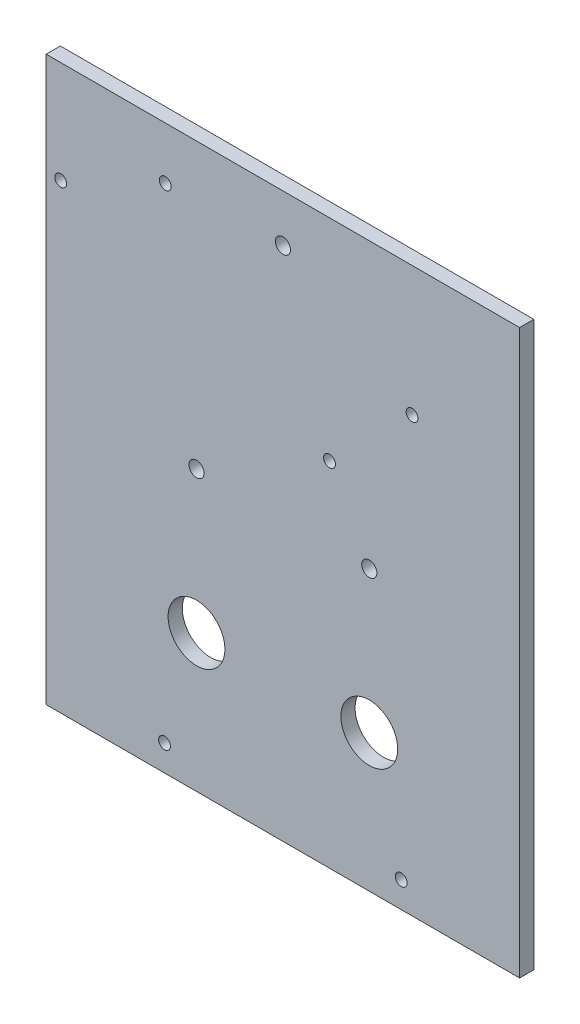
ISO-10303-21;
HEADER;
FILE_DESCRIPTION(('STEP AP214'),'2;1');
FILE_NAME('part.step','',(''),(''),'','','');
FILE_SCHEMA(('AUTOMOTIVE_DESIGN { 1 0 10303 214 1 1 1 1 }'));
ENDSEC;
DATA;
#1=APPLICATION_CONTEXT('core data for automotive mechanical design processes');
#2=APPLICATION_PROTOCOL_DEFINITION('international standard','automotive_design',2000,#1);
#3=PRODUCT_CONTEXT('',#1,'mechanical');
#4=PRODUCT('Part','Part','',(#3));
#5=PRODUCT_RELATED_PRODUCT_CATEGORY('part','',(#4));
#6=PRODUCT_DEFINITION_FORMATION('','',#4);
#7=PRODUCT_DEFINITION_CONTEXT('part definition',#1,'design');
#8=PRODUCT_DEFINITION('design','',#6,#7);
#9=PRODUCT_DEFINITION_SHAPE('','',#8);
#10=(LENGTH_UNIT() NAMED_UNIT(*) SI_UNIT(.MILLI.,.METRE.));
#11=(NAMED_UNIT(*) PLANE_ANGLE_UNIT() SI_UNIT($,.RADIAN.));
#12=(NAMED_UNIT(*) SI_UNIT($,.STERADIAN.) SOLID_ANGLE_UNIT());
#13=UNCERTAINTY_MEASURE_WITH_UNIT(LENGTH_MEASURE(1.E-05),#10,'distance_accuracy_value','');
#14=(GEOMETRIC_REPRESENTATION_CONTEXT(3) GLOBAL_UNCERTAINTY_ASSIGNED_CONTEXT((#13)) GLOBAL_UNIT_ASSIGNED_CONTEXT((#10,
#11,#12)) REPRESENTATION_CONTEXT('',''));
#15=CARTESIAN_POINT('',(0.,0.,0.));
#16=DIRECTION('',(0.,0.,1.));
#17=DIRECTION('',(1.,0.,0.));
#18=AXIS2_PLACEMENT_3D('',#15,#16,#17);
#19=CARTESIAN_POINT('',(50.,0.,3.));
#20=DIRECTION('',(1.,0.,0.));
#21=DIRECTION('',(0.,1.,0.));
#22=AXIS2_PLACEMENT_3D('',#19,#20,#21);
#23=PLANE('',#22);
#24=DIRECTION('',(0.,0.,1.));
#25=VECTOR('',#24,1.);
#26=CARTESIAN_POINT('',(50.,-59.,3.));
#27=LINE('',#26,#25);
#28=CARTESIAN_POINT('',(50.,-59.,0.));
#29=VERTEX_POINT('',#28);
#30=CARTESIAN_POINT('',(50.,-59.,3.));
#31=VERTEX_POINT('',#30);
#32=EDGE_CURVE('E141',#29,#31,#27,.T.);
#33=ORIENTED_EDGE('',*,*,#32,.F.);
#34=DIRECTION('',(0.,-1.,0.));
#35=VECTOR('',#34,1.);
#36=CARTESIAN_POINT('',(50.,0.,0.));
#37=LINE('',#36,#35);
#38=CARTESIAN_POINT('',(50.,60.,0.));
#39=VERTEX_POINT('',#38);
#40=EDGE_CURVE('E86',#39,#29,#37,.T.);
#41=ORIENTED_EDGE('',*,*,#40,.F.);
#42=DIRECTION('',(0.,0.,-1.));
#43=VECTOR('',#42,1.);
#44=CARTESIAN_POINT('',(50.,60.,3.));
#45=LINE('',#44,#43);
#46=CARTESIAN_POINT('',(50.,60.,3.));
#47=VERTEX_POINT('',#46);
#48=EDGE_CURVE('E11',#47,#39,#45,.T.);
#49=ORIENTED_EDGE('',*,*,#48,.F.);
#50=DIRECTION('',(0.,-1.,0.));
#51=VECTOR('',#50,1.);
#52=CARTESIAN_POINT('',(50.,0.,3.));
#53=LINE('',#52,#51);
#54=EDGE_CURVE('E82',#47,#31,#53,.T.);
#55=ORIENTED_EDGE('',*,*,#54,.T.);
#56=EDGE_LOOP('',(#33,#41,#49,#55));
#57=FACE_BOUND('',#56,.T.);
#58=ADVANCED_FACE('F34',(#57),#23,.T.);
#59=CARTESIAN_POINT('',(0.,60.,3.));
#60=DIRECTION('',(0.,1.,0.));
#61=DIRECTION('',(0.,0.,1.));
#62=AXIS2_PLACEMENT_3D('',#59,#60,#61);
#63=PLANE('',#62);
#64=DIRECTION('',(1.,0.,0.));
#65=VECTOR('',#64,1.);
#66=CARTESIAN_POINT('',(0.,60.,0.));
#67=LINE('',#66,#65);
#68=CARTESIAN_POINT('',(-50.,60.,0.));
#69=VERTEX_POINT('',#68);
#70=EDGE_CURVE('E80',#69,#39,#67,.T.);
#71=ORIENTED_EDGE('',*,*,#70,.F.);
#72=DIRECTION('',(0.,0.,-1.));
#73=VECTOR('',#72,1.);
#74=CARTESIAN_POINT('',(-50.,60.,3.));
#75=LINE('',#74,#73);
#76=CARTESIAN_POINT('',(-50.,60.,3.));
#77=VERTEX_POINT('',#76);
#78=EDGE_CURVE('E42',#77,#69,#75,.T.);
#79=ORIENTED_EDGE('',*,*,#78,.F.);
#80=DIRECTION('',(1.,0.,0.));
#81=VECTOR('',#80,1.);
#82=CARTESIAN_POINT('',(0.,60.,3.));
#83=LINE('',#82,#81);
#84=EDGE_CURVE('E128',#77,#47,#83,.T.);
#85=ORIENTED_EDGE('',*,*,#84,.T.);
#86=ORIENTED_EDGE('',*,*,#48,.T.);
#87=EDGE_LOOP('',(#71,#79,#85,#86));
#88=FACE_BOUND('',#87,.T.);
#89=ADVANCED_FACE('F84',(#88),#63,.T.);
#90=CARTESIAN_POINT('',(-50.,0.,3.));
#91=DIRECTION('',(1.,0.,0.));
#92=DIRECTION('',(0.,1.,0.));
#93=AXIS2_PLACEMENT_3D('',#90,#91,#92);
#94=PLANE('',#93);
#95=DIRECTION('',(0.,-1.,0.));
#96=VECTOR('',#95,1.);
#97=CARTESIAN_POINT('',(-50.,0.,0.));
#98=LINE('',#97,#96);
#99=CARTESIAN_POINT('',(-50.,-59.,0.));
#100=VERTEX_POINT('',#99);
#101=EDGE_CURVE('E71',#69,#100,#98,.T.);
#102=ORIENTED_EDGE('',*,*,#101,.T.);
#103=DIRECTION('',(0.,0.,-1.));
#104=VECTOR('',#103,1.);
#105=CARTESIAN_POINT('',(-50.,-59.,3.));
#106=LINE('',#105,#104);
#107=CARTESIAN_POINT('',(-50.,-59.,3.));
#108=VERTEX_POINT('',#107);
#109=EDGE_CURVE('E50',#108,#100,#106,.T.);
#110=ORIENTED_EDGE('',*,*,#109,.F.);
#111=DIRECTION('',(0.,-1.,0.));
#112=VECTOR('',#111,1.);
#113=CARTESIAN_POINT('',(-50.,0.,3.));
#114=LINE('',#113,#112);
#115=EDGE_CURVE('E73',#77,#108,#114,.T.);
#116=ORIENTED_EDGE('',*,*,#115,.F.);
#117=ORIENTED_EDGE('',*,*,#78,.T.);
#118=EDGE_LOOP('',(#102,#110,#116,#117));
#119=FACE_BOUND('',#118,.T.);
#120=ADVANCED_FACE('F70',(#119),#94,.F.);
#121=CARTESIAN_POINT('',(0.,0.,3.));
#122=DIRECTION('',(0.,0.,1.));
#123=DIRECTION('',(1.,0.,0.));
#124=AXIS2_PLACEMENT_3D('',#121,#122,#123);
#125=PLANE('',#124);
#126=CARTESIAN_POINT('',(24.9944522468405,-53.5142314480857,3.));
#127=DIRECTION('',(0.,0.,1.));
#128=DIRECTION('',(1.,0.,0.));
#129=AXIS2_PLACEMENT_3D('',#126,#127,#128);
#130=CIRCLE('',#129,1.24999999999999);
#131=CARTESIAN_POINT('',(26.2444522468405,-53.5142314480857,3.));
#132=VERTEX_POINT('',#131);
#133=EDGE_CURVE('E177',#132,#132,#130,.T.);
#134=ORIENTED_EDGE('',*,*,#133,.F.);
#135=EDGE_LOOP('',(#134));
#136=FACE_BOUND('',#135,.T.);
#137=CARTESIAN_POINT('',(-25.0000416541344,-53.5000093071889,3.));
#138=DIRECTION('',(0.,0.,1.));
#139=DIRECTION('',(1.,0.,0.));
#140=AXIS2_PLACEMENT_3D('',#137,#138,#139);
#141=CIRCLE('',#140,1.24999999999999);
#142=CARTESIAN_POINT('',(-23.7500416541344,-53.5000093071889,3.));
#143=VERTEX_POINT('',#142);
#144=EDGE_CURVE('E174',#143,#143,#141,.T.);
#145=ORIENTED_EDGE('',*,*,#144,.F.);
#146=EDGE_LOOP('',(#145));
#147=FACE_BOUND('',#146,.T.);
#148=CARTESIAN_POINT('',(-24.8530881084712,48.9540104681269,3.));
#149=DIRECTION('',(0.,0.,1.));
#150=DIRECTION('',(1.,0.,0.));
#151=AXIS2_PLACEMENT_3D('',#148,#149,#150);
#152=CIRCLE('',#151,1.24999999999999);
#153=CARTESIAN_POINT('',(-23.6030881084712,48.9540104681269,3.));
#154=VERTEX_POINT('',#153);
#155=EDGE_CURVE('E165',#154,#154,#152,.T.);
#156=ORIENTED_EDGE('',*,*,#155,.F.);
#157=EDGE_LOOP('',(#156));
#158=FACE_BOUND('',#157,.T.);
#159=CARTESIAN_POINT('',(27.2852993583041,32.6288385347021,3.));
#160=DIRECTION('',(0.,0.,1.));
#161=DIRECTION('',(1.,0.,0.));
#162=AXIS2_PLACEMENT_3D('',#159,#160,#161);
#163=CIRCLE('',#162,1.24999999999999);
#164=CARTESIAN_POINT('',(28.5352993583041,32.6288385347021,3.));
#165=VERTEX_POINT('',#164);
#166=EDGE_CURVE('E159',#165,#165,#163,.T.);
#167=ORIENTED_EDGE('',*,*,#166,.F.);
#168=EDGE_LOOP('',(#167));
#169=FACE_BOUND('',#168,.T.);
#170=CARTESIAN_POINT('',(9.84369881857999,15.5106563000243,3.));
#171=DIRECTION('',(0.,0.,1.));
#172=DIRECTION('',(1.,0.,0.));
#173=AXIS2_PLACEMENT_3D('',#170,#171,#172);
#174=CIRCLE('',#173,1.24999999999999);
#175=CARTESIAN_POINT('',(11.09369881858,15.5106563000243,3.));
#176=VERTEX_POINT('',#175);
#177=EDGE_CURVE('E153',#176,#176,#174,.T.);
#178=ORIENTED_EDGE('',*,*,#177,.F.);
#179=EDGE_LOOP('',(#178));
#180=FACE_BOUND('',#179,.T.);
#181=CARTESIAN_POINT('',(-46.9397651106338,38.4479049697117,3.));
#182=DIRECTION('',(0.,0.,1.));
#183=DIRECTION('',(1.,0.,0.));
#184=AXIS2_PLACEMENT_3D('',#181,#182,#183);
#185=CIRCLE('',#184,1.24999999999999);
#186=CARTESIAN_POINT('',(-45.6897651106339,38.4479049697117,3.));
#187=VERTEX_POINT('',#186);
#188=EDGE_CURVE('E144',#187,#187,#185,.T.);
#189=ORIENTED_EDGE('',*,*,#188,.F.);
#190=EDGE_LOOP('',(#189));
#191=FACE_BOUND('',#190,.T.);
#192=DIRECTION('',(-1.,0.,0.));
#193=VECTOR('',#192,1.);
#194=CARTESIAN_POINT('',(50.,-59.,3.));
#195=LINE('',#194,#193);
#196=EDGE_CURVE('E136',#31,#108,#195,.T.);
#197=ORIENTED_EDGE('',*,*,#196,.F.);
#198=ORIENTED_EDGE('',*,*,#54,.F.);
#199=ORIENTED_EDGE('',*,*,#84,.F.);
#200=ORIENTED_EDGE('',*,*,#115,.T.);
#201=EDGE_LOOP('',(#197,#198,#199,#200));
#202=FACE_BOUND('',#201,.T.);
#203=CARTESIAN_POINT('',(0.,50.,3.));
#204=DIRECTION('',(0.,0.,1.));
#205=DIRECTION('',(1.,0.,0.));
#206=AXIS2_PLACEMENT_3D('',#203,#204,#205);
#207=CIRCLE('',#206,1.6);
#208=CARTESIAN_POINT('',(1.6,50.,3.));
#209=VERTEX_POINT('',#208);
#210=EDGE_CURVE('E94',#209,#209,#207,.T.);
#211=ORIENTED_EDGE('',*,*,#210,.F.);
#212=EDGE_LOOP('',(#211));
#213=FACE_BOUND('',#212,.T.);
#214=CARTESIAN_POINT('',(18.25,0.,3.));
#215=DIRECTION('',(0.,0.,1.));
#216=DIRECTION('',(1.,0.,0.));
#217=AXIS2_PLACEMENT_3D('',#214,#215,#216);
#218=CIRCLE('',#217,1.6);
#219=CARTESIAN_POINT('',(19.85,0.,3.));
#220=VERTEX_POINT('',#219);
#221=EDGE_CURVE('E111',#220,#220,#218,.T.);
#222=ORIENTED_EDGE('',*,*,#221,.F.);
#223=EDGE_LOOP('',(#222));
#224=FACE_BOUND('',#223,.T.);
#225=CARTESIAN_POINT('',(-18.25,0.,3.));
#226=DIRECTION('',(0.,0.,1.));
#227=DIRECTION('',(1.,0.,0.));
#228=AXIS2_PLACEMENT_3D('',#225,#226,#227);
#229=CIRCLE('',#228,1.6);
#230=CARTESIAN_POINT('',(-16.65,0.,3.));
#231=VERTEX_POINT('',#230);
#232=EDGE_CURVE('E93',#231,#231,#229,.T.);
#233=ORIENTED_EDGE('',*,*,#232,.F.);
#234=EDGE_LOOP('',(#233));
#235=FACE_BOUND('',#234,.T.);
#236=CARTESIAN_POINT('',(18.25,-30.,3.));
#237=DIRECTION('',(0.,0.,1.));
#238=DIRECTION('',(1.,0.,0.));
#239=AXIS2_PLACEMENT_3D('',#236,#237,#238);
#240=CIRCLE('',#239,6.);
#241=CARTESIAN_POINT('',(24.25,-30.,3.));
#242=VERTEX_POINT('',#241);
#243=EDGE_CURVE('E118',#242,#242,#240,.T.);
#244=ORIENTED_EDGE('',*,*,#243,.F.);
#245=EDGE_LOOP('',(#244));
#246=FACE_BOUND('',#245,.T.);
#247=CARTESIAN_POINT('',(-18.25,-30.,3.));
#248=DIRECTION('',(0.,0.,1.));
#249=DIRECTION('',(1.,0.,0.));
#250=AXIS2_PLACEMENT_3D('',#247,#248,#249);
#251=CIRCLE('',#250,6.);
#252=CARTESIAN_POINT('',(-12.25,-30.,3.));
#253=VERTEX_POINT('',#252);
#254=EDGE_CURVE('E110',#253,#253,#251,.T.);
#255=ORIENTED_EDGE('',*,*,#254,.F.);
#256=EDGE_LOOP('',(#255));
#257=FACE_BOUND('',#256,.T.);
#258=ADVANCED_FACE('F132',(#136,#147,#158,#169,#180,#191,#202,#213,#224,#235,#246,#257),#125,.T.);
#259=CARTESIAN_POINT('',(0.,0.,0.));
#260=DIRECTION('',(0.,0.,1.));
#261=DIRECTION('',(1.,0.,0.));
#262=AXIS2_PLACEMENT_3D('',#259,#260,#261);
#263=PLANE('',#262);
#264=CARTESIAN_POINT('',(24.9944522468405,-53.5142314480857,0.));
#265=DIRECTION('',(0.,0.,1.));
#266=DIRECTION('',(1.,0.,0.));
#267=AXIS2_PLACEMENT_3D('',#264,#265,#266);
#268=CIRCLE('',#267,1.24999999999999);
#269=CARTESIAN_POINT('',(26.2444522468405,-53.5142314480857,0.));
#270=VERTEX_POINT('',#269);
#271=EDGE_CURVE('E37',#270,#270,#268,.T.);
#272=ORIENTED_EDGE('',*,*,#271,.T.);
#273=EDGE_LOOP('',(#272));
#274=FACE_BOUND('',#273,.T.);
#275=CARTESIAN_POINT('',(-25.0000416541344,-53.5000093071889,0.));
#276=DIRECTION('',(0.,0.,1.));
#277=DIRECTION('',(1.,0.,0.));
#278=AXIS2_PLACEMENT_3D('',#275,#276,#277);
#279=CIRCLE('',#278,1.24999999999999);
#280=CARTESIAN_POINT('',(-23.7500416541344,-53.5000093071889,0.));
#281=VERTEX_POINT('',#280);
#282=EDGE_CURVE('E171',#281,#281,#279,.T.);
#283=ORIENTED_EDGE('',*,*,#282,.T.);
#284=EDGE_LOOP('',(#283));
#285=FACE_BOUND('',#284,.T.);
#286=CARTESIAN_POINT('',(-24.8530881084712,48.9540104681269,0.));
#287=DIRECTION('',(0.,0.,-1.));
#288=DIRECTION('',(-1.,0.,0.));
#289=AXIS2_PLACEMENT_3D('',#286,#287,#288);
#290=CIRCLE('',#289,1.24999999999999);
#291=CARTESIAN_POINT('',(-26.1030881084712,48.9540104681269,0.));
#292=VERTEX_POINT('',#291);
#293=EDGE_CURVE('E168',#292,#292,#290,.T.);
#294=ORIENTED_EDGE('',*,*,#293,.F.);
#295=EDGE_LOOP('',(#294));
#296=FACE_BOUND('',#295,.T.);
#297=CARTESIAN_POINT('',(27.2852993583041,32.6288385347021,0.));
#298=DIRECTION('',(0.,0.,-1.));
#299=DIRECTION('',(-1.,0.,0.));
#300=AXIS2_PLACEMENT_3D('',#297,#298,#299);
#301=CIRCLE('',#300,1.24999999999999);
#302=CARTESIAN_POINT('',(26.0352993583041,32.6288385347021,0.));
#303=VERTEX_POINT('',#302);
#304=EDGE_CURVE('E162',#303,#303,#301,.T.);
#305=ORIENTED_EDGE('',*,*,#304,.F.);
#306=EDGE_LOOP('',(#305));
#307=FACE_BOUND('',#306,.T.);
#308=CARTESIAN_POINT('',(9.84369881857999,15.5106563000243,0.));
#309=DIRECTION('',(0.,0.,-1.));
#310=DIRECTION('',(-1.,0.,0.));
#311=AXIS2_PLACEMENT_3D('',#308,#309,#310);
#312=CIRCLE('',#311,1.24999999999999);
#313=CARTESIAN_POINT('',(8.59369881858,15.5106563000243,0.));
#314=VERTEX_POINT('',#313);
#315=EDGE_CURVE('E156',#314,#314,#312,.T.);
#316=ORIENTED_EDGE('',*,*,#315,.F.);
#317=EDGE_LOOP('',(#316));
#318=FACE_BOUND('',#317,.T.);
#319=CARTESIAN_POINT('',(-46.9397651106338,38.4479049697117,0.));
#320=DIRECTION('',(0.,0.,-1.));
#321=DIRECTION('',(-1.,0.,0.));
#322=AXIS2_PLACEMENT_3D('',#319,#320,#321);
#323=CIRCLE('',#322,1.24999999999999);
#324=CARTESIAN_POINT('',(-48.1897651106338,38.4479049697117,0.));
#325=VERTEX_POINT('',#324);
#326=EDGE_CURVE('E148',#325,#325,#323,.T.);
#327=ORIENTED_EDGE('',*,*,#326,.F.);
#328=EDGE_LOOP('',(#327));
#329=FACE_BOUND('',#328,.T.);
#330=CARTESIAN_POINT('',(0.,50.,0.));
#331=DIRECTION('',(0.,0.,1.));
#332=DIRECTION('',(1.,0.,0.));
#333=AXIS2_PLACEMENT_3D('',#330,#331,#332);
#334=CIRCLE('',#333,1.6);
#335=CARTESIAN_POINT('',(1.6,50.,0.));
#336=VERTEX_POINT('',#335);
#337=EDGE_CURVE('E91',#336,#336,#334,.T.);
#338=ORIENTED_EDGE('',*,*,#337,.T.);
#339=EDGE_LOOP('',(#338));
#340=FACE_BOUND('',#339,.T.);
#341=CARTESIAN_POINT('',(18.25,0.,0.));
#342=DIRECTION('',(0.,0.,1.));
#343=DIRECTION('',(1.,0.,0.));
#344=AXIS2_PLACEMENT_3D('',#341,#342,#343);
#345=CIRCLE('',#344,1.6);
#346=CARTESIAN_POINT('',(19.85,0.,0.));
#347=VERTEX_POINT('',#346);
#348=EDGE_CURVE('E107',#347,#347,#345,.T.);
#349=ORIENTED_EDGE('',*,*,#348,.T.);
#350=EDGE_LOOP('',(#349));
#351=FACE_BOUND('',#350,.T.);
#352=CARTESIAN_POINT('',(-18.25,0.,0.));
#353=DIRECTION('',(0.,0.,1.));
#354=DIRECTION('',(1.,0.,0.));
#355=AXIS2_PLACEMENT_3D('',#352,#353,#354);
#356=CIRCLE('',#355,1.6);
#357=CARTESIAN_POINT('',(-16.65,0.,0.));
#358=VERTEX_POINT('',#357);
#359=EDGE_CURVE('E98',#358,#358,#356,.T.);
#360=ORIENTED_EDGE('',*,*,#359,.T.);
#361=EDGE_LOOP('',(#360));
#362=FACE_BOUND('',#361,.T.);
#363=CARTESIAN_POINT('',(18.25,-30.,0.));
#364=DIRECTION('',(0.,0.,1.));
#365=DIRECTION('',(1.,0.,0.));
#366=AXIS2_PLACEMENT_3D('',#363,#364,#365);
#367=CIRCLE('',#366,6.);
#368=CARTESIAN_POINT('',(24.25,-30.,0.));
#369=VERTEX_POINT('',#368);
#370=EDGE_CURVE('E88',#369,#369,#367,.T.);
#371=ORIENTED_EDGE('',*,*,#370,.T.);
#372=EDGE_LOOP('',(#371));
#373=FACE_BOUND('',#372,.T.);
#374=CARTESIAN_POINT('',(-18.25,-30.,0.));
#375=DIRECTION('',(0.,0.,1.));
#376=DIRECTION('',(1.,0.,0.));
#377=AXIS2_PLACEMENT_3D('',#374,#375,#376);
#378=CIRCLE('',#377,6.);
#379=CARTESIAN_POINT('',(-12.25,-30.,0.));
#380=VERTEX_POINT('',#379);
#381=EDGE_CURVE('E121',#380,#380,#378,.T.);
#382=ORIENTED_EDGE('',*,*,#381,.T.);
#383=EDGE_LOOP('',(#382));
#384=FACE_BOUND('',#383,.T.);
#385=ORIENTED_EDGE('',*,*,#40,.T.);
#386=DIRECTION('',(1.,0.,0.));
#387=VECTOR('',#386,1.);
#388=CARTESIAN_POINT('',(50.,-59.,0.));
#389=LINE('',#388,#387);
#390=EDGE_CURVE('E81',#100,#29,#389,.T.);
#391=ORIENTED_EDGE('',*,*,#390,.F.);
#392=ORIENTED_EDGE('',*,*,#101,.F.);
#393=ORIENTED_EDGE('',*,*,#70,.T.);
#394=EDGE_LOOP('',(#385,#391,#392,#393));
#395=FACE_BOUND('',#394,.T.);
#396=ADVANCED_FACE('F79',(#274,#285,#296,#307,#318,#329,#340,#351,#362,#373,#384,#395),#263,.F.);
#397=CARTESIAN_POINT('',(-18.25,-30.,0.));
#398=DIRECTION('',(0.,0.,1.));
#399=DIRECTION('',(1.,0.,0.));
#400=AXIS2_PLACEMENT_3D('',#397,#398,#399);
#401=CYLINDRICAL_SURFACE('',#400,6.);
#402=ORIENTED_EDGE('',*,*,#381,.F.);
#403=EDGE_LOOP('',(#402));
#404=FACE_BOUND('',#403,.T.);
#405=ORIENTED_EDGE('',*,*,#254,.T.);
#406=EDGE_LOOP('',(#405));
#407=FACE_BOUND('',#406,.T.);
#408=ADVANCED_FACE('F207',(#404,#407),#401,.F.);
#409=CARTESIAN_POINT('',(18.25,-30.,0.));
#410=DIRECTION('',(0.,0.,1.));
#411=DIRECTION('',(1.,0.,0.));
#412=AXIS2_PLACEMENT_3D('',#409,#410,#411);
#413=CYLINDRICAL_SURFACE('',#412,6.);
#414=ORIENTED_EDGE('',*,*,#370,.F.);
#415=EDGE_LOOP('',(#414));
#416=FACE_BOUND('',#415,.T.);
#417=ORIENTED_EDGE('',*,*,#243,.T.);
#418=EDGE_LOOP('',(#417));
#419=FACE_BOUND('',#418,.T.);
#420=ADVANCED_FACE('F213',(#416,#419),#413,.F.);
#421=CARTESIAN_POINT('',(-18.25,0.,0.));
#422=DIRECTION('',(0.,0.,1.));
#423=DIRECTION('',(1.,0.,0.));
#424=AXIS2_PLACEMENT_3D('',#421,#422,#423);
#425=CYLINDRICAL_SURFACE('',#424,1.6);
#426=ORIENTED_EDGE('',*,*,#359,.F.);
#427=EDGE_LOOP('',(#426));
#428=FACE_BOUND('',#427,.T.);
#429=ORIENTED_EDGE('',*,*,#232,.T.);
#430=EDGE_LOOP('',(#429));
#431=FACE_BOUND('',#430,.T.);
#432=ADVANCED_FACE('F217',(#428,#431),#425,.F.);
#433=CARTESIAN_POINT('',(18.25,0.,0.));
#434=DIRECTION('',(0.,0.,1.));
#435=DIRECTION('',(1.,0.,0.));
#436=AXIS2_PLACEMENT_3D('',#433,#434,#435);
#437=CYLINDRICAL_SURFACE('',#436,1.6);
#438=ORIENTED_EDGE('',*,*,#348,.F.);
#439=EDGE_LOOP('',(#438));
#440=FACE_BOUND('',#439,.T.);
#441=ORIENTED_EDGE('',*,*,#221,.T.);
#442=EDGE_LOOP('',(#441));
#443=FACE_BOUND('',#442,.T.);
#444=ADVANCED_FACE('F221',(#440,#443),#437,.F.);
#445=CARTESIAN_POINT('',(0.,50.,-7.));
#446=DIRECTION('',(0.,0.,1.));
#447=DIRECTION('',(1.,0.,0.));
#448=AXIS2_PLACEMENT_3D('',#445,#446,#447);
#449=CYLINDRICAL_SURFACE('',#448,1.6);
#450=ORIENTED_EDGE('',*,*,#210,.T.);
#451=EDGE_LOOP('',(#450));
#452=FACE_BOUND('',#451,.T.);
#453=ORIENTED_EDGE('',*,*,#337,.F.);
#454=EDGE_LOOP('',(#453));
#455=FACE_BOUND('',#454,.T.);
#456=ADVANCED_FACE('F225',(#452,#455),#449,.F.);
#457=CARTESIAN_POINT('',(0.,-59.,0.));
#458=DIRECTION('',(0.,1.,0.));
#459=DIRECTION('',(0.,0.,1.));
#460=AXIS2_PLACEMENT_3D('',#457,#458,#459);
#461=PLANE('',#460);
#462=ORIENTED_EDGE('',*,*,#32,.T.);
#463=ORIENTED_EDGE('',*,*,#196,.T.);
#464=ORIENTED_EDGE('',*,*,#109,.T.);
#465=ORIENTED_EDGE('',*,*,#390,.T.);
#466=EDGE_LOOP('',(#462,#463,#464,#465));
#467=FACE_BOUND('',#466,.T.);
#468=ADVANCED_FACE('F142',(#467),#461,.F.);
#469=CARTESIAN_POINT('',(-46.9397651106338,38.4479049697117,0.));
#470=DIRECTION('',(0.,0.,-1.));
#471=DIRECTION('',(-1.,0.,0.));
#472=AXIS2_PLACEMENT_3D('',#469,#470,#471);
#473=CYLINDRICAL_SURFACE('',#472,1.24999999999999);
#474=ORIENTED_EDGE('',*,*,#188,.T.);
#475=EDGE_LOOP('',(#474));
#476=FACE_BOUND('',#475,.T.);
#477=ORIENTED_EDGE('',*,*,#326,.T.);
#478=EDGE_LOOP('',(#477));
#479=FACE_BOUND('',#478,.T.);
#480=ADVANCED_FACE('F231',(#476,#479),#473,.F.);
#481=CARTESIAN_POINT('',(9.84369881857999,15.5106563000243,0.));
#482=DIRECTION('',(0.,0.,-1.));
#483=DIRECTION('',(-1.,0.,0.));
#484=AXIS2_PLACEMENT_3D('',#481,#482,#483);
#485=CYLINDRICAL_SURFACE('',#484,1.24999999999999);
#486=ORIENTED_EDGE('',*,*,#177,.T.);
#487=EDGE_LOOP('',(#486));
#488=FACE_BOUND('',#487,.T.);
#489=ORIENTED_EDGE('',*,*,#315,.T.);
#490=EDGE_LOOP('',(#489));
#491=FACE_BOUND('',#490,.T.);
#492=ADVANCED_FACE('F234',(#488,#491),#485,.F.);
#493=CARTESIAN_POINT('',(27.2852993583041,32.6288385347021,0.));
#494=DIRECTION('',(0.,0.,-1.));
#495=DIRECTION('',(-1.,0.,0.));
#496=AXIS2_PLACEMENT_3D('',#493,#494,#495);
#497=CYLINDRICAL_SURFACE('',#496,1.24999999999999);
#498=ORIENTED_EDGE('',*,*,#166,.T.);
#499=EDGE_LOOP('',(#498));
#500=FACE_BOUND('',#499,.T.);
#501=ORIENTED_EDGE('',*,*,#304,.T.);
#502=EDGE_LOOP('',(#501));
#503=FACE_BOUND('',#502,.T.);
#504=ADVANCED_FACE('F238',(#500,#503),#497,.F.);
#505=CARTESIAN_POINT('',(-24.8530881084712,48.9540104681269,0.));
#506=DIRECTION('',(0.,0.,-1.));
#507=DIRECTION('',(-1.,0.,0.));
#508=AXIS2_PLACEMENT_3D('',#505,#506,#507);
#509=CYLINDRICAL_SURFACE('',#508,1.24999999999999);
#510=ORIENTED_EDGE('',*,*,#155,.T.);
#511=EDGE_LOOP('',(#510));
#512=FACE_BOUND('',#511,.T.);
#513=ORIENTED_EDGE('',*,*,#293,.T.);
#514=EDGE_LOOP('',(#513));
#515=FACE_BOUND('',#514,.T.);
#516=ADVANCED_FACE('F193',(#512,#515),#509,.F.);
#517=CARTESIAN_POINT('',(-25.0000416541344,-53.5000093071889,3.));
#518=DIRECTION('',(0.,0.,1.));
#519=DIRECTION('',(1.,0.,0.));
#520=AXIS2_PLACEMENT_3D('',#517,#518,#519);
#521=CYLINDRICAL_SURFACE('',#520,1.24999999999999);
#522=ORIENTED_EDGE('',*,*,#144,.T.);
#523=EDGE_LOOP('',(#522));
#524=FACE_BOUND('',#523,.T.);
#525=ORIENTED_EDGE('',*,*,#282,.F.);
#526=EDGE_LOOP('',(#525));
#527=FACE_BOUND('',#526,.T.);
#528=ADVANCED_FACE('F188',(#524,#527),#521,.F.);
#529=CARTESIAN_POINT('',(24.9944522468405,-53.5142314480857,3.));
#530=DIRECTION('',(0.,0.,1.));
#531=DIRECTION('',(1.,0.,0.));
#532=AXIS2_PLACEMENT_3D('',#529,#530,#531);
#533=CYLINDRICAL_SURFACE('',#532,1.24999999999999);
#534=ORIENTED_EDGE('',*,*,#133,.T.);
#535=EDGE_LOOP('',(#534));
#536=FACE_BOUND('',#535,.T.);
#537=ORIENTED_EDGE('',*,*,#271,.F.);
#538=EDGE_LOOP('',(#537));
#539=FACE_BOUND('',#538,.T.);
#540=ADVANCED_FACE('F186',(#536,#539),#533,.F.);
#541=CLOSED_SHELL('',(#58,#89,#120,#258,#396,#408,#420,#432,#444,#456,#468,#480,#492,#504,#516,
#528,#540));
#542=MANIFOLD_SOLID_BREP('B2',#541);
#543=ADVANCED_BREP_SHAPE_REPRESENTATION('',(#18,#542),#14);
#544=SHAPE_DEFINITION_REPRESENTATION(#9,#543);
ENDSEC;
END-ISO-10303-21;
